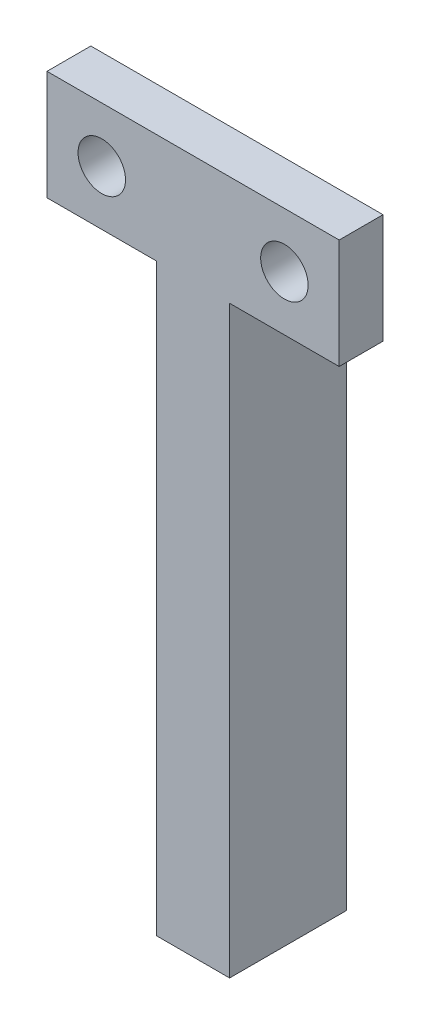
ISO-10303-21;
HEADER;
FILE_DESCRIPTION(('STEP AP214'),'2;1');
FILE_NAME('part.step','',(''),(''),'','','');
FILE_SCHEMA(('AUTOMOTIVE_DESIGN { 1 0 10303 214 1 1 1 1 }'));
ENDSEC;
DATA;
#1=APPLICATION_CONTEXT('core data for automotive mechanical design processes');
#2=APPLICATION_PROTOCOL_DEFINITION('international standard','automotive_design',2000,#1);
#3=PRODUCT_CONTEXT('',#1,'mechanical');
#4=PRODUCT('Part','Part','',(#3));
#5=PRODUCT_RELATED_PRODUCT_CATEGORY('part','',(#4));
#6=PRODUCT_DEFINITION_FORMATION('','',#4);
#7=PRODUCT_DEFINITION_CONTEXT('part definition',#1,'design');
#8=PRODUCT_DEFINITION('design','',#6,#7);
#9=PRODUCT_DEFINITION_SHAPE('','',#8);
#10=(LENGTH_UNIT() NAMED_UNIT(*) SI_UNIT(.MILLI.,.METRE.));
#11=(NAMED_UNIT(*) PLANE_ANGLE_UNIT() SI_UNIT($,.RADIAN.));
#12=(NAMED_UNIT(*) SI_UNIT($,.STERADIAN.) SOLID_ANGLE_UNIT());
#13=UNCERTAINTY_MEASURE_WITH_UNIT(LENGTH_MEASURE(1.E-05),#10,'distance_accuracy_value','');
#14=(GEOMETRIC_REPRESENTATION_CONTEXT(3) GLOBAL_UNCERTAINTY_ASSIGNED_CONTEXT((#13)) GLOBAL_UNIT_ASSIGNED_CONTEXT((#10,
#11,#12)) REPRESENTATION_CONTEXT('',''));
#15=CARTESIAN_POINT('',(0.,0.,0.));
#16=DIRECTION('',(0.,0.,1.));
#17=DIRECTION('',(1.,0.,0.));
#18=AXIS2_PLACEMENT_3D('',#15,#16,#17);
#19=CARTESIAN_POINT('',(0.,0.,3.));
#20=DIRECTION('',(0.,0.,-1.));
#21=DIRECTION('',(-1.,0.,0.));
#22=AXIS2_PLACEMENT_3D('',#19,#20,#21);
#23=PLANE('',#22);
#24=DIRECTION('',(1.,0.,0.));
#25=VECTOR('',#24,1.);
#26=CARTESIAN_POINT('',(5.,0.,3.));
#27=LINE('',#26,#25);
#28=CARTESIAN_POINT('',(0.,0.,3.));
#29=VERTEX_POINT('',#28);
#30=CARTESIAN_POINT('',(5.,0.,3.));
#31=VERTEX_POINT('',#30);
#32=EDGE_CURVE('E143',#29,#31,#27,.T.);
#33=ORIENTED_EDGE('',*,*,#32,.T.);
#34=DIRECTION('',(0.,1.,0.));
#35=VECTOR('',#34,1.);
#36=CARTESIAN_POINT('',(5.,40.,3.));
#37=LINE('',#36,#35);
#38=CARTESIAN_POINT('',(5.,40.,3.));
#39=VERTEX_POINT('',#38);
#40=EDGE_CURVE('E91',#31,#39,#37,.T.);
#41=ORIENTED_EDGE('',*,*,#40,.T.);
#42=DIRECTION('',(1.,0.,0.));
#43=VECTOR('',#42,1.);
#44=CARTESIAN_POINT('',(12.5,40.,3.));
#45=LINE('',#44,#43);
#46=CARTESIAN_POINT('',(12.5,40.,3.));
#47=VERTEX_POINT('',#46);
#48=EDGE_CURVE('E156',#39,#47,#45,.T.);
#49=ORIENTED_EDGE('',*,*,#48,.T.);
#50=DIRECTION('',(0.,1.,0.));
#51=VECTOR('',#50,1.);
#52=CARTESIAN_POINT('',(12.5,47.5,3.));
#53=LINE('',#52,#51);
#54=CARTESIAN_POINT('',(12.5,47.5,3.));
#55=VERTEX_POINT('',#54);
#56=EDGE_CURVE('E192',#47,#55,#53,.T.);
#57=ORIENTED_EDGE('',*,*,#56,.T.);
#58=DIRECTION('',(-1.,0.,0.));
#59=VECTOR('',#58,1.);
#60=CARTESIAN_POINT('',(-7.5,47.5,3.));
#61=LINE('',#60,#59);
#62=CARTESIAN_POINT('',(-7.5,47.5,3.));
#63=VERTEX_POINT('',#62);
#64=EDGE_CURVE('E113',#55,#63,#61,.T.);
#65=ORIENTED_EDGE('',*,*,#64,.T.);
#66=DIRECTION('',(0.,-1.,0.));
#67=VECTOR('',#66,1.);
#68=CARTESIAN_POINT('',(-7.5,40.,3.));
#69=LINE('',#68,#67);
#70=CARTESIAN_POINT('',(-7.5,40.,3.));
#71=VERTEX_POINT('',#70);
#72=EDGE_CURVE('E108',#63,#71,#69,.T.);
#73=ORIENTED_EDGE('',*,*,#72,.T.);
#74=DIRECTION('',(1.,0.,0.));
#75=VECTOR('',#74,1.);
#76=CARTESIAN_POINT('',(0.,40.,3.));
#77=LINE('',#76,#75);
#78=CARTESIAN_POINT('',(0.,40.,3.));
#79=VERTEX_POINT('',#78);
#80=EDGE_CURVE('E115',#71,#79,#77,.T.);
#81=ORIENTED_EDGE('',*,*,#80,.T.);
#82=DIRECTION('',(0.,-1.,0.));
#83=VECTOR('',#82,1.);
#84=CARTESIAN_POINT('',(0.,0.,3.));
#85=LINE('',#84,#83);
#86=EDGE_CURVE('E57',#79,#29,#85,.T.);
#87=ORIENTED_EDGE('',*,*,#86,.T.);
#88=EDGE_LOOP('',(#33,#41,#49,#57,#65,#73,#81,#87));
#89=FACE_BOUND('',#88,.T.);
#90=CARTESIAN_POINT('',(-3.75,43.75,3.));
#91=DIRECTION('',(0.,0.,1.));
#92=DIRECTION('',(1.,0.,0.));
#93=AXIS2_PLACEMENT_3D('',#90,#91,#92);
#94=CIRCLE('',#93,1.625);
#95=CARTESIAN_POINT('',(-2.125,43.75,3.));
#96=VERTEX_POINT('',#95);
#97=EDGE_CURVE('E135',#96,#96,#94,.T.);
#98=ORIENTED_EDGE('',*,*,#97,.F.);
#99=EDGE_LOOP('',(#98));
#100=FACE_BOUND('',#99,.T.);
#101=CARTESIAN_POINT('',(8.74999999999999,43.75,3.));
#102=DIRECTION('',(0.,0.,1.));
#103=DIRECTION('',(1.,0.,0.));
#104=AXIS2_PLACEMENT_3D('',#101,#102,#103);
#105=CIRCLE('',#104,1.625);
#106=CARTESIAN_POINT('',(10.375,43.75,3.));
#107=VERTEX_POINT('',#106);
#108=EDGE_CURVE('E179',#107,#107,#105,.T.);
#109=ORIENTED_EDGE('',*,*,#108,.F.);
#110=EDGE_LOOP('',(#109));
#111=FACE_BOUND('',#110,.T.);
#112=ADVANCED_FACE('F39',(#89,#100,#111),#23,.F.);
#113=CARTESIAN_POINT('',(0.,0.,0.));
#114=DIRECTION('',(0.,0.,-1.));
#115=DIRECTION('',(-1.,0.,0.));
#116=AXIS2_PLACEMENT_3D('',#113,#114,#115);
#117=PLANE('',#116);
#118=DIRECTION('',(1.,0.,0.));
#119=VECTOR('',#118,1.);
#120=CARTESIAN_POINT('',(5.,40.,0.));
#121=LINE('',#120,#119);
#122=CARTESIAN_POINT('',(0.,40.,0.));
#123=VERTEX_POINT('',#122);
#124=CARTESIAN_POINT('',(5.,40.,0.));
#125=VERTEX_POINT('',#124);
#126=EDGE_CURVE('E84',#123,#125,#121,.T.);
#127=ORIENTED_EDGE('',*,*,#126,.F.);
#128=DIRECTION('',(1.,0.,0.));
#129=VECTOR('',#128,1.);
#130=CARTESIAN_POINT('',(0.,40.,0.));
#131=LINE('',#130,#129);
#132=CARTESIAN_POINT('',(-7.5,40.,0.));
#133=VERTEX_POINT('',#132);
#134=EDGE_CURVE('E138',#133,#123,#131,.T.);
#135=ORIENTED_EDGE('',*,*,#134,.F.);
#136=DIRECTION('',(0.,-1.,0.));
#137=VECTOR('',#136,1.);
#138=CARTESIAN_POINT('',(-7.5,40.,0.));
#139=LINE('',#138,#137);
#140=CARTESIAN_POINT('',(-7.5,47.5,0.));
#141=VERTEX_POINT('',#140);
#142=EDGE_CURVE('E79',#141,#133,#139,.T.);
#143=ORIENTED_EDGE('',*,*,#142,.F.);
#144=DIRECTION('',(-1.,0.,0.));
#145=VECTOR('',#144,1.);
#146=CARTESIAN_POINT('',(-7.5,47.5,0.));
#147=LINE('',#146,#145);
#148=CARTESIAN_POINT('',(12.5,47.5,0.));
#149=VERTEX_POINT('',#148);
#150=EDGE_CURVE('E136',#149,#141,#147,.T.);
#151=ORIENTED_EDGE('',*,*,#150,.F.);
#152=DIRECTION('',(0.,1.,0.));
#153=VECTOR('',#152,1.);
#154=CARTESIAN_POINT('',(12.5,47.5,0.));
#155=LINE('',#154,#153);
#156=CARTESIAN_POINT('',(12.5,40.,0.));
#157=VERTEX_POINT('',#156);
#158=EDGE_CURVE('E132',#157,#149,#155,.T.);
#159=ORIENTED_EDGE('',*,*,#158,.F.);
#160=DIRECTION('',(1.,0.,0.));
#161=VECTOR('',#160,1.);
#162=CARTESIAN_POINT('',(12.5,40.,0.));
#163=LINE('',#162,#161);
#164=EDGE_CURVE('E133',#125,#157,#163,.T.);
#165=ORIENTED_EDGE('',*,*,#164,.F.);
#166=EDGE_LOOP('',(#127,#135,#143,#151,#159,#165));
#167=FACE_BOUND('',#166,.T.);
#168=CARTESIAN_POINT('',(-3.75,43.75,0.));
#169=DIRECTION('',(0.,0.,1.));
#170=DIRECTION('',(1.,0.,0.));
#171=AXIS2_PLACEMENT_3D('',#168,#169,#170);
#172=CIRCLE('',#171,1.625);
#173=CARTESIAN_POINT('',(-2.125,43.75,0.));
#174=VERTEX_POINT('',#173);
#175=EDGE_CURVE('E181',#174,#174,#172,.T.);
#176=ORIENTED_EDGE('',*,*,#175,.T.);
#177=EDGE_LOOP('',(#176));
#178=FACE_BOUND('',#177,.T.);
#179=CARTESIAN_POINT('',(8.74999999999999,43.75,0.));
#180=DIRECTION('',(0.,0.,1.));
#181=DIRECTION('',(1.,0.,0.));
#182=AXIS2_PLACEMENT_3D('',#179,#180,#181);
#183=CIRCLE('',#182,1.625);
#184=CARTESIAN_POINT('',(10.375,43.75,0.));
#185=VERTEX_POINT('',#184);
#186=EDGE_CURVE('E175',#185,#185,#183,.T.);
#187=ORIENTED_EDGE('',*,*,#186,.T.);
#188=EDGE_LOOP('',(#187));
#189=FACE_BOUND('',#188,.T.);
#190=ADVANCED_FACE('F205',(#167,#178,#189),#117,.T.);
#191=CARTESIAN_POINT('',(5.,0.,3.));
#192=DIRECTION('',(0.,1.,0.));
#193=DIRECTION('',(0.,0.,1.));
#194=AXIS2_PLACEMENT_3D('',#191,#192,#193);
#195=PLANE('',#194);
#196=DIRECTION('',(0.,0.,-1.));
#197=VECTOR('',#196,1.);
#198=CARTESIAN_POINT('',(0.,0.,3.));
#199=LINE('',#198,#197);
#200=CARTESIAN_POINT('',(0.,0.,-5.));
#201=VERTEX_POINT('',#200);
#202=EDGE_CURVE('E130',#29,#201,#199,.T.);
#203=ORIENTED_EDGE('',*,*,#202,.T.);
#204=DIRECTION('',(-1.,0.,0.));
#205=VECTOR('',#204,1.);
#206=CARTESIAN_POINT('',(5.,0.,-5.));
#207=LINE('',#206,#205);
#208=CARTESIAN_POINT('',(5.,0.,-5.));
#209=VERTEX_POINT('',#208);
#210=EDGE_CURVE('E214',#209,#201,#207,.T.);
#211=ORIENTED_EDGE('',*,*,#210,.F.);
#212=DIRECTION('',(0.,0.,-1.));
#213=VECTOR('',#212,1.);
#214=CARTESIAN_POINT('',(5.,0.,3.));
#215=LINE('',#214,#213);
#216=EDGE_CURVE('E11',#31,#209,#215,.T.);
#217=ORIENTED_EDGE('',*,*,#216,.F.);
#218=ORIENTED_EDGE('',*,*,#32,.F.);
#219=EDGE_LOOP('',(#203,#211,#217,#218));
#220=FACE_BOUND('',#219,.T.);
#221=ADVANCED_FACE('F41',(#220),#195,.F.);
#222=CARTESIAN_POINT('',(5.,40.,3.));
#223=DIRECTION('',(-1.,0.,0.));
#224=DIRECTION('',(0.,-1.,0.));
#225=AXIS2_PLACEMENT_3D('',#222,#223,#224);
#226=PLANE('',#225);
#227=ORIENTED_EDGE('',*,*,#216,.T.);
#228=DIRECTION('',(0.,-1.,0.));
#229=VECTOR('',#228,1.);
#230=CARTESIAN_POINT('',(5.,40.,-5.));
#231=LINE('',#230,#229);
#232=CARTESIAN_POINT('',(5.,40.,-5.));
#233=VERTEX_POINT('',#232);
#234=EDGE_CURVE('E169',#233,#209,#231,.T.);
#235=ORIENTED_EDGE('',*,*,#234,.F.);
#236=DIRECTION('',(0.,0.,1.));
#237=VECTOR('',#236,1.);
#238=CARTESIAN_POINT('',(5.,40.,-5.));
#239=LINE('',#238,#237);
#240=EDGE_CURVE('E163',#233,#125,#239,.T.);
#241=ORIENTED_EDGE('',*,*,#240,.T.);
#242=DIRECTION('',(0.,0.,-1.));
#243=VECTOR('',#242,1.);
#244=CARTESIAN_POINT('',(5.,40.,3.));
#245=LINE('',#244,#243);
#246=EDGE_CURVE('E48',#39,#125,#245,.T.);
#247=ORIENTED_EDGE('',*,*,#246,.F.);
#248=ORIENTED_EDGE('',*,*,#40,.F.);
#249=EDGE_LOOP('',(#227,#235,#241,#247,#248));
#250=FACE_BOUND('',#249,.T.);
#251=ADVANCED_FACE('F168',(#250),#226,.F.);
#252=CARTESIAN_POINT('',(12.5,40.,3.));
#253=DIRECTION('',(0.,1.,0.));
#254=DIRECTION('',(-1.,0.,0.));
#255=AXIS2_PLACEMENT_3D('',#252,#253,#254);
#256=PLANE('',#255);
#257=ORIENTED_EDGE('',*,*,#164,.T.);
#258=DIRECTION('',(0.,0.,-1.));
#259=VECTOR('',#258,1.);
#260=CARTESIAN_POINT('',(12.5,40.,3.));
#261=LINE('',#260,#259);
#262=EDGE_CURVE('E149',#47,#157,#261,.T.);
#263=ORIENTED_EDGE('',*,*,#262,.F.);
#264=ORIENTED_EDGE('',*,*,#48,.F.);
#265=ORIENTED_EDGE('',*,*,#246,.T.);
#266=EDGE_LOOP('',(#257,#263,#264,#265));
#267=FACE_BOUND('',#266,.T.);
#268=ADVANCED_FACE('F152',(#267),#256,.F.);
#269=CARTESIAN_POINT('',(12.5,47.5,3.));
#270=DIRECTION('',(-1.,0.,0.));
#271=DIRECTION('',(0.,-1.,0.));
#272=AXIS2_PLACEMENT_3D('',#269,#270,#271);
#273=PLANE('',#272);
#274=ORIENTED_EDGE('',*,*,#158,.T.);
#275=DIRECTION('',(0.,0.,-1.));
#276=VECTOR('',#275,1.);
#277=CARTESIAN_POINT('',(12.5,47.5,3.));
#278=LINE('',#277,#276);
#279=EDGE_CURVE('E148',#55,#149,#278,.T.);
#280=ORIENTED_EDGE('',*,*,#279,.F.);
#281=ORIENTED_EDGE('',*,*,#56,.F.);
#282=ORIENTED_EDGE('',*,*,#262,.T.);
#283=EDGE_LOOP('',(#274,#280,#281,#282));
#284=FACE_BOUND('',#283,.T.);
#285=ADVANCED_FACE('F197',(#284),#273,.F.);
#286=CARTESIAN_POINT('',(-7.5,47.5,3.));
#287=DIRECTION('',(0.,-1.,0.));
#288=DIRECTION('',(0.,0.,-1.));
#289=AXIS2_PLACEMENT_3D('',#286,#287,#288);
#290=PLANE('',#289);
#291=ORIENTED_EDGE('',*,*,#150,.T.);
#292=DIRECTION('',(0.,0.,-1.));
#293=VECTOR('',#292,1.);
#294=CARTESIAN_POINT('',(-7.5,47.5,3.));
#295=LINE('',#294,#293);
#296=EDGE_CURVE('E121',#63,#141,#295,.T.);
#297=ORIENTED_EDGE('',*,*,#296,.F.);
#298=ORIENTED_EDGE('',*,*,#64,.F.);
#299=ORIENTED_EDGE('',*,*,#279,.T.);
#300=EDGE_LOOP('',(#291,#297,#298,#299));
#301=FACE_BOUND('',#300,.T.);
#302=ADVANCED_FACE('F203',(#301),#290,.F.);
#303=CARTESIAN_POINT('',(-7.5,40.,3.));
#304=DIRECTION('',(1.,0.,0.));
#305=DIRECTION('',(0.,0.,-1.));
#306=AXIS2_PLACEMENT_3D('',#303,#304,#305);
#307=PLANE('',#306);
#308=ORIENTED_EDGE('',*,*,#142,.T.);
#309=DIRECTION('',(0.,0.,-1.));
#310=VECTOR('',#309,1.);
#311=CARTESIAN_POINT('',(-7.5,40.,3.));
#312=LINE('',#311,#310);
#313=EDGE_CURVE('E117',#71,#133,#312,.T.);
#314=ORIENTED_EDGE('',*,*,#313,.F.);
#315=ORIENTED_EDGE('',*,*,#72,.F.);
#316=ORIENTED_EDGE('',*,*,#296,.T.);
#317=EDGE_LOOP('',(#308,#314,#315,#316));
#318=FACE_BOUND('',#317,.T.);
#319=ADVANCED_FACE('F120',(#318),#307,.F.);
#320=CARTESIAN_POINT('',(0.,40.,3.));
#321=DIRECTION('',(0.,1.,0.));
#322=DIRECTION('',(-1.,0.,0.));
#323=AXIS2_PLACEMENT_3D('',#320,#321,#322);
#324=PLANE('',#323);
#325=ORIENTED_EDGE('',*,*,#134,.T.);
#326=DIRECTION('',(0.,0.,-1.));
#327=VECTOR('',#326,1.);
#328=CARTESIAN_POINT('',(0.,40.,3.));
#329=LINE('',#328,#327);
#330=EDGE_CURVE('E125',#79,#123,#329,.T.);
#331=ORIENTED_EDGE('',*,*,#330,.F.);
#332=ORIENTED_EDGE('',*,*,#80,.F.);
#333=ORIENTED_EDGE('',*,*,#313,.T.);
#334=EDGE_LOOP('',(#325,#331,#332,#333));
#335=FACE_BOUND('',#334,.T.);
#336=ADVANCED_FACE('F123',(#335),#324,.F.);
#337=CARTESIAN_POINT('',(0.,0.,3.));
#338=DIRECTION('',(1.,0.,0.));
#339=DIRECTION('',(0.,0.,-1.));
#340=AXIS2_PLACEMENT_3D('',#337,#338,#339);
#341=PLANE('',#340);
#342=ORIENTED_EDGE('',*,*,#330,.T.);
#343=DIRECTION('',(0.,0.,1.));
#344=VECTOR('',#343,1.);
#345=CARTESIAN_POINT('',(0.,40.,-5.));
#346=LINE('',#345,#344);
#347=CARTESIAN_POINT('',(0.,40.,-5.));
#348=VERTEX_POINT('',#347);
#349=EDGE_CURVE('E170',#348,#123,#346,.T.);
#350=ORIENTED_EDGE('',*,*,#349,.F.);
#351=DIRECTION('',(0.,1.,0.));
#352=VECTOR('',#351,1.);
#353=CARTESIAN_POINT('',(0.,40.,-5.));
#354=LINE('',#353,#352);
#355=EDGE_CURVE('E180',#201,#348,#354,.T.);
#356=ORIENTED_EDGE('',*,*,#355,.F.);
#357=ORIENTED_EDGE('',*,*,#202,.F.);
#358=ORIENTED_EDGE('',*,*,#86,.F.);
#359=EDGE_LOOP('',(#342,#350,#356,#357,#358));
#360=FACE_BOUND('',#359,.T.);
#361=ADVANCED_FACE('F202',(#360),#341,.F.);
#362=CARTESIAN_POINT('',(-3.75,43.75,3.));
#363=DIRECTION('',(0.,0.,-1.));
#364=DIRECTION('',(-1.,0.,0.));
#365=AXIS2_PLACEMENT_3D('',#362,#363,#364);
#366=CYLINDRICAL_SURFACE('',#365,1.625);
#367=ORIENTED_EDGE('',*,*,#97,.T.);
#368=EDGE_LOOP('',(#367));
#369=FACE_BOUND('',#368,.T.);
#370=ORIENTED_EDGE('',*,*,#175,.F.);
#371=EDGE_LOOP('',(#370));
#372=FACE_BOUND('',#371,.T.);
#373=ADVANCED_FACE('F239',(#369,#372),#366,.F.);
#374=CARTESIAN_POINT('',(8.74999999999999,43.75,3.));
#375=DIRECTION('',(0.,0.,-1.));
#376=DIRECTION('',(-1.,0.,0.));
#377=AXIS2_PLACEMENT_3D('',#374,#375,#376);
#378=CYLINDRICAL_SURFACE('',#377,1.625);
#379=ORIENTED_EDGE('',*,*,#108,.T.);
#380=EDGE_LOOP('',(#379));
#381=FACE_BOUND('',#380,.T.);
#382=ORIENTED_EDGE('',*,*,#186,.F.);
#383=EDGE_LOOP('',(#382));
#384=FACE_BOUND('',#383,.T.);
#385=ADVANCED_FACE('F230',(#381,#384),#378,.F.);
#386=CARTESIAN_POINT('',(5.,40.,-5.));
#387=DIRECTION('',(0.,-1.,0.));
#388=DIRECTION('',(0.,0.,-1.));
#389=AXIS2_PLACEMENT_3D('',#386,#387,#388);
#390=PLANE('',#389);
#391=ORIENTED_EDGE('',*,*,#126,.T.);
#392=ORIENTED_EDGE('',*,*,#240,.F.);
#393=DIRECTION('',(1.,0.,0.));
#394=VECTOR('',#393,1.);
#395=CARTESIAN_POINT('',(5.,40.,-5.));
#396=LINE('',#395,#394);
#397=EDGE_CURVE('E174',#348,#233,#396,.T.);
#398=ORIENTED_EDGE('',*,*,#397,.F.);
#399=ORIENTED_EDGE('',*,*,#349,.T.);
#400=EDGE_LOOP('',(#391,#392,#398,#399));
#401=FACE_BOUND('',#400,.T.);
#402=ADVANCED_FACE('F165',(#401),#390,.F.);
#403=CARTESIAN_POINT('',(0.,0.,-5.));
#404=DIRECTION('',(0.,0.,-1.));
#405=DIRECTION('',(-1.,0.,0.));
#406=AXIS2_PLACEMENT_3D('',#403,#404,#405);
#407=PLANE('',#406);
#408=ORIENTED_EDGE('',*,*,#234,.T.);
#409=ORIENTED_EDGE('',*,*,#210,.T.);
#410=ORIENTED_EDGE('',*,*,#355,.T.);
#411=ORIENTED_EDGE('',*,*,#397,.T.);
#412=EDGE_LOOP('',(#408,#409,#410,#411));
#413=FACE_BOUND('',#412,.T.);
#414=ADVANCED_FACE('F219',(#413),#407,.T.);
#415=CLOSED_SHELL('',(#112,#190,#221,#251,#268,#285,#302,#319,#336,#361,#373,#385,#402,#414));
#416=MANIFOLD_SOLID_BREP('B2',#415);
#417=ADVANCED_BREP_SHAPE_REPRESENTATION('',(#18,#416),#14);
#418=SHAPE_DEFINITION_REPRESENTATION(#9,#417);
ENDSEC;
END-ISO-10303-21;
